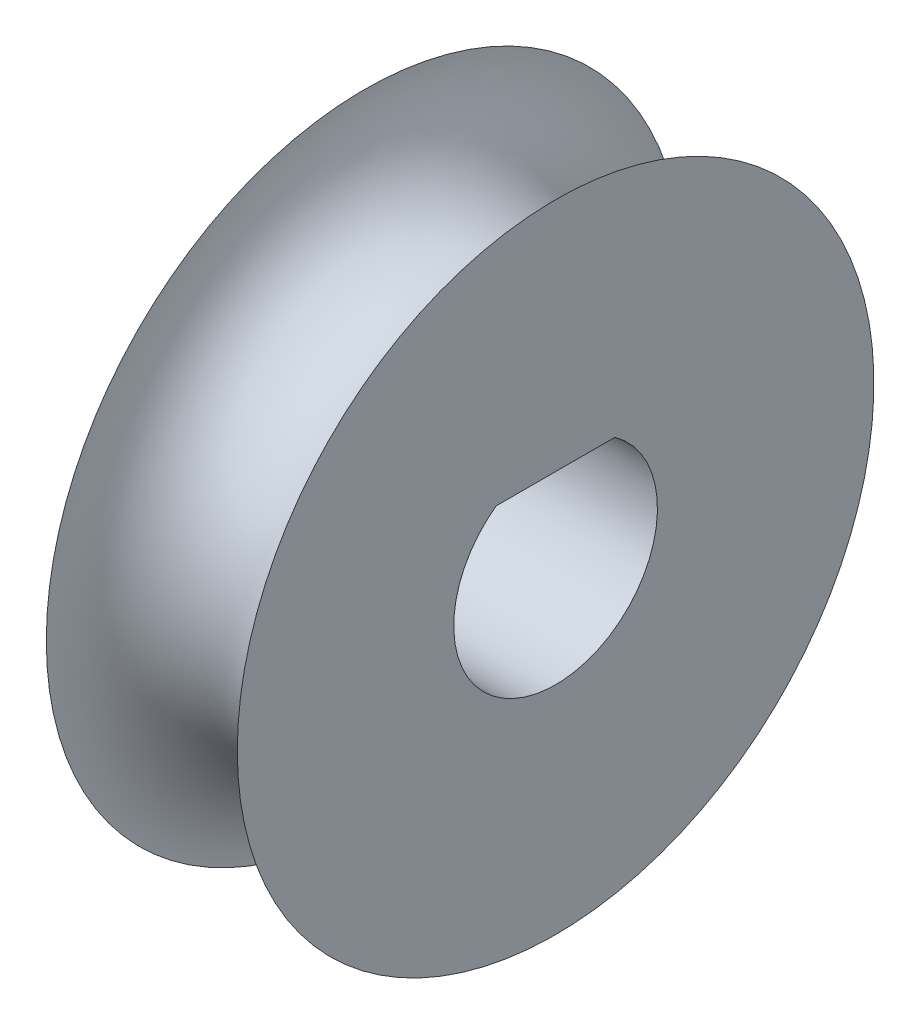
ISO-10303-21;
HEADER;
FILE_DESCRIPTION(('STEP AP214'),'2;1');
FILE_NAME('part.step','',(''),(''),'','','');
FILE_SCHEMA(('AUTOMOTIVE_DESIGN { 1 0 10303 214 1 1 1 1 }'));
ENDSEC;
DATA;
#1=APPLICATION_CONTEXT('core data for automotive mechanical design processes');
#2=APPLICATION_PROTOCOL_DEFINITION('international standard','automotive_design',2000,#1);
#3=PRODUCT_CONTEXT('',#1,'mechanical');
#4=PRODUCT('Part','Part','',(#3));
#5=PRODUCT_RELATED_PRODUCT_CATEGORY('part','',(#4));
#6=PRODUCT_DEFINITION_FORMATION('','',#4);
#7=PRODUCT_DEFINITION_CONTEXT('part definition',#1,'design');
#8=PRODUCT_DEFINITION('design','',#6,#7);
#9=PRODUCT_DEFINITION_SHAPE('','',#8);
#10=(LENGTH_UNIT() NAMED_UNIT(*) SI_UNIT(.MILLI.,.METRE.));
#11=(NAMED_UNIT(*) PLANE_ANGLE_UNIT() SI_UNIT($,.RADIAN.));
#12=(NAMED_UNIT(*) SI_UNIT($,.STERADIAN.) SOLID_ANGLE_UNIT());
#13=UNCERTAINTY_MEASURE_WITH_UNIT(LENGTH_MEASURE(1.E-05),#10,'distance_accuracy_value','');
#14=(GEOMETRIC_REPRESENTATION_CONTEXT(3) GLOBAL_UNCERTAINTY_ASSIGNED_CONTEXT((#13)) GLOBAL_UNIT_ASSIGNED_CONTEXT((#10,
#11,#12)) REPRESENTATION_CONTEXT('',''));
#15=CARTESIAN_POINT('',(0.,0.,0.));
#16=DIRECTION('',(0.,0.,1.));
#17=DIRECTION('',(1.,0.,0.));
#18=AXIS2_PLACEMENT_3D('',#15,#16,#17);
#19=CARTESIAN_POINT('',(0.,0.,0.));
#20=DIRECTION('',(-1.,0.,0.));
#21=DIRECTION('',(0.,0.,1.));
#22=AXIS2_PLACEMENT_3D('',#19,#20,#21);
#23=TOROIDAL_SURFACE('',#22,12.7000001164153,3.81);
#24=CARTESIAN_POINT('',(3.81,0.,0.));
#25=DIRECTION('',(-1.,0.,0.));
#26=DIRECTION('',(0.,0.,1.));
#27=AXIS2_PLACEMENT_3D('',#24,#25,#26);
#28=CIRCLE('',#27,12.7);
#29=CARTESIAN_POINT('',(3.81,0.,12.7));
#30=VERTEX_POINT('',#29);
#31=EDGE_CURVE('E40',#30,#30,#28,.T.);
#32=ORIENTED_EDGE('',*,*,#31,.T.);
#33=EDGE_LOOP('',(#32));
#34=FACE_BOUND('',#33,.T.);
#35=CARTESIAN_POINT('',(-3.81,0.,0.));
#36=DIRECTION('',(-1.,0.,0.));
#37=DIRECTION('',(0.,0.,1.));
#38=AXIS2_PLACEMENT_3D('',#35,#36,#37);
#39=CIRCLE('',#38,12.7);
#40=CARTESIAN_POINT('',(-3.81,0.,12.7));
#41=VERTEX_POINT('',#40);
#42=EDGE_CURVE('E11',#41,#41,#39,.T.);
#43=ORIENTED_EDGE('',*,*,#42,.F.);
#44=EDGE_LOOP('',(#43));
#45=FACE_BOUND('',#44,.T.);
#46=ADVANCED_FACE('F33',(#34,#45),#23,.F.);
#47=CARTESIAN_POINT('',(-3.81,12.7,0.));
#48=DIRECTION('',(1.,0.,0.));
#49=DIRECTION('',(0.,0.,-1.));
#50=AXIS2_PLACEMENT_3D('',#47,#48,#49);
#51=PLANE('',#50);
#52=DIRECTION('',(0.,0.,1.));
#53=VECTOR('',#52,1.);
#54=CARTESIAN_POINT('',(-3.81,3.302,2.36915427948456));
#55=LINE('',#54,#53);
#56=CARTESIAN_POINT('',(-3.81,3.302,-2.36915427948456));
#57=VERTEX_POINT('',#56);
#58=CARTESIAN_POINT('',(-3.81,3.302,2.36915427948456));
#59=VERTEX_POINT('',#58);
#60=EDGE_CURVE('E74',#57,#59,#55,.T.);
#61=ORIENTED_EDGE('',*,*,#60,.T.);
#62=CARTESIAN_POINT('',(-3.81,0.,0.));
#63=DIRECTION('',(1.,0.,0.));
#64=DIRECTION('',(0.,0.,-1.));
#65=AXIS2_PLACEMENT_3D('',#62,#63,#64);
#66=CIRCLE('',#65,4.064);
#67=EDGE_CURVE('E47',#59,#57,#66,.T.);
#68=ORIENTED_EDGE('',*,*,#67,.T.);
#69=EDGE_LOOP('',(#61,#68));
#70=FACE_BOUND('',#69,.T.);
#71=ORIENTED_EDGE('',*,*,#42,.T.);
#72=EDGE_LOOP('',(#71));
#73=FACE_BOUND('',#72,.T.);
#74=ADVANCED_FACE('F82',(#70,#73),#51,.F.);
#75=CARTESIAN_POINT('',(3.81,12.7,0.));
#76=DIRECTION('',(1.,0.,0.));
#77=DIRECTION('',(0.,0.,-1.));
#78=AXIS2_PLACEMENT_3D('',#75,#76,#77);
#79=PLANE('',#78);
#80=CARTESIAN_POINT('',(3.81,0.,0.));
#81=DIRECTION('',(1.,0.,0.));
#82=DIRECTION('',(0.,0.,-1.));
#83=AXIS2_PLACEMENT_3D('',#80,#81,#82);
#84=CIRCLE('',#83,4.064);
#85=CARTESIAN_POINT('',(3.81,3.302,2.36915427948456));
#86=VERTEX_POINT('',#85);
#87=CARTESIAN_POINT('',(3.81,3.302,-2.36915427948456));
#88=VERTEX_POINT('',#87);
#89=EDGE_CURVE('E52',#86,#88,#84,.T.);
#90=ORIENTED_EDGE('',*,*,#89,.F.);
#91=DIRECTION('',(0.,0.,1.));
#92=VECTOR('',#91,1.);
#93=CARTESIAN_POINT('',(3.81,3.302,2.36915427948456));
#94=LINE('',#93,#92);
#95=EDGE_CURVE('E66',#88,#86,#94,.T.);
#96=ORIENTED_EDGE('',*,*,#95,.F.);
#97=EDGE_LOOP('',(#90,#96));
#98=FACE_BOUND('',#97,.T.);
#99=ORIENTED_EDGE('',*,*,#31,.F.);
#100=EDGE_LOOP('',(#99));
#101=FACE_BOUND('',#100,.T.);
#102=ADVANCED_FACE('F70',(#98,#101),#79,.T.);
#103=CARTESIAN_POINT('',(-3.81,0.,0.));
#104=DIRECTION('',(1.,0.,0.));
#105=DIRECTION('',(0.,0.,-1.));
#106=AXIS2_PLACEMENT_3D('',#103,#104,#105);
#107=CYLINDRICAL_SURFACE('',#106,4.064);
#108=ORIENTED_EDGE('',*,*,#89,.T.);
#109=DIRECTION('',(1.,0.,0.));
#110=VECTOR('',#109,1.);
#111=CARTESIAN_POINT('',(-3.81,3.302,-2.36915427948456));
#112=LINE('',#111,#110);
#113=EDGE_CURVE('E63',#57,#88,#112,.T.);
#114=ORIENTED_EDGE('',*,*,#113,.F.);
#115=ORIENTED_EDGE('',*,*,#67,.F.);
#116=DIRECTION('',(1.,0.,0.));
#117=VECTOR('',#116,1.);
#118=CARTESIAN_POINT('',(-3.81,3.302,2.36915427948456));
#119=LINE('',#118,#117);
#120=EDGE_CURVE('E57',#59,#86,#119,.T.);
#121=ORIENTED_EDGE('',*,*,#120,.T.);
#122=EDGE_LOOP('',(#108,#114,#115,#121));
#123=FACE_BOUND('',#122,.T.);
#124=ADVANCED_FACE('F59',(#123),#107,.F.);
#125=CARTESIAN_POINT('',(-3.81,3.302,2.36915427948456));
#126=DIRECTION('',(0.,1.,0.));
#127=DIRECTION('',(0.,0.,1.));
#128=AXIS2_PLACEMENT_3D('',#125,#126,#127);
#129=PLANE('',#128);
#130=ORIENTED_EDGE('',*,*,#95,.T.);
#131=ORIENTED_EDGE('',*,*,#120,.F.);
#132=ORIENTED_EDGE('',*,*,#60,.F.);
#133=ORIENTED_EDGE('',*,*,#113,.T.);
#134=EDGE_LOOP('',(#130,#131,#132,#133));
#135=FACE_BOUND('',#134,.T.);
#136=ADVANCED_FACE('F67',(#135),#129,.F.);
#137=CLOSED_SHELL('',(#46,#74,#102,#124,#136));
#138=MANIFOLD_SOLID_BREP('B2',#137);
#139=ADVANCED_BREP_SHAPE_REPRESENTATION('',(#18,#138),#14);
#140=SHAPE_DEFINITION_REPRESENTATION(#9,#139);
ENDSEC;
END-ISO-10303-21;
